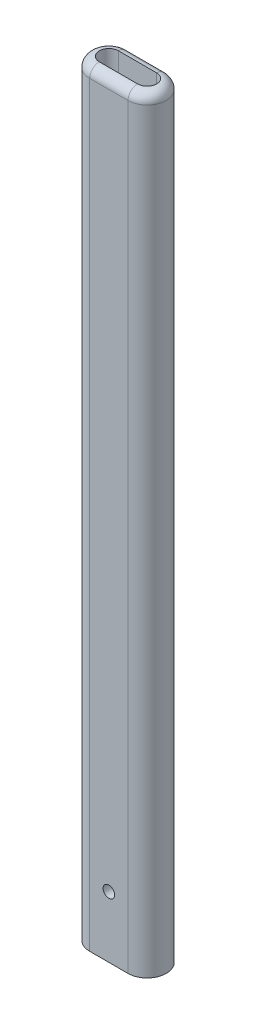
ISO-10303-21;
HEADER;
FILE_DESCRIPTION(('STEP AP214'),'2;1');
FILE_NAME('part.step','',(''),(''),'','','');
FILE_SCHEMA(('AUTOMOTIVE_DESIGN { 1 0 10303 214 1 1 1 1 }'));
ENDSEC;
DATA;
#1=APPLICATION_CONTEXT('core data for automotive mechanical design processes');
#2=APPLICATION_PROTOCOL_DEFINITION('international standard','automotive_design',2000,#1);
#3=PRODUCT_CONTEXT('',#1,'mechanical');
#4=PRODUCT('Part','Part','',(#3));
#5=PRODUCT_RELATED_PRODUCT_CATEGORY('part','',(#4));
#6=PRODUCT_DEFINITION_FORMATION('','',#4);
#7=PRODUCT_DEFINITION_CONTEXT('part definition',#1,'design');
#8=PRODUCT_DEFINITION('design','',#6,#7);
#9=PRODUCT_DEFINITION_SHAPE('','',#8);
#10=(LENGTH_UNIT() NAMED_UNIT(*) SI_UNIT(.MILLI.,.METRE.));
#11=(NAMED_UNIT(*) PLANE_ANGLE_UNIT() SI_UNIT($,.RADIAN.));
#12=(NAMED_UNIT(*) SI_UNIT($,.STERADIAN.) SOLID_ANGLE_UNIT());
#13=UNCERTAINTY_MEASURE_WITH_UNIT(LENGTH_MEASURE(1.E-05),#10,'distance_accuracy_value','');
#14=(GEOMETRIC_REPRESENTATION_CONTEXT(3) GLOBAL_UNCERTAINTY_ASSIGNED_CONTEXT((#13)) GLOBAL_UNIT_ASSIGNED_CONTEXT((#10,
#11,#12)) REPRESENTATION_CONTEXT('',''));
#15=CARTESIAN_POINT('',(0.,0.,0.));
#16=DIRECTION('',(0.,0.,1.));
#17=DIRECTION('',(1.,0.,0.));
#18=AXIS2_PLACEMENT_3D('',#15,#16,#17);
#19=CARTESIAN_POINT('',(-15.,-200.,0.));
#20=DIRECTION('',(0.,1.,0.));
#21=DIRECTION('',(0.,0.,1.));
#22=AXIS2_PLACEMENT_3D('',#19,#20,#21);
#23=PLANE('',#22);
#24=CARTESIAN_POINT('',(-15.,-200.,0.));
#25=DIRECTION('',(0.,1.,0.));
#26=DIRECTION('',(0.,0.,1.));
#27=AXIS2_PLACEMENT_3D('',#24,#25,#26);
#28=CIRCLE('',#27,10.);
#29=CARTESIAN_POINT('',(-15.,-200.,-10.));
#30=VERTEX_POINT('',#29);
#31=CARTESIAN_POINT('',(-15.,-200.,10.));
#32=VERTEX_POINT('',#31);
#33=EDGE_CURVE('E135',#30,#32,#28,.T.);
#34=ORIENTED_EDGE('',*,*,#33,.F.);
#35=DIRECTION('',(-1.,0.,0.));
#36=VECTOR('',#35,1.);
#37=CARTESIAN_POINT('',(-15.,-200.,-10.));
#38=LINE('',#37,#36);
#39=CARTESIAN_POINT('',(5.,-200.,-10.));
#40=VERTEX_POINT('',#39);
#41=EDGE_CURVE('E150',#40,#30,#38,.T.);
#42=ORIENTED_EDGE('',*,*,#41,.F.);
#43=CARTESIAN_POINT('',(5.,-200.,0.));
#44=DIRECTION('',(0.,1.,0.));
#45=DIRECTION('',(0.,0.,1.));
#46=AXIS2_PLACEMENT_3D('',#43,#44,#45);
#47=CIRCLE('',#46,10.);
#48=CARTESIAN_POINT('',(5.,-200.,10.));
#49=VERTEX_POINT('',#48);
#50=EDGE_CURVE('E147',#49,#40,#47,.T.);
#51=ORIENTED_EDGE('',*,*,#50,.F.);
#52=DIRECTION('',(1.,0.,0.));
#53=VECTOR('',#52,1.);
#54=CARTESIAN_POINT('',(-15.,-200.,10.));
#55=LINE('',#54,#53);
#56=EDGE_CURVE('E139',#32,#49,#55,.T.);
#57=ORIENTED_EDGE('',*,*,#56,.F.);
#58=EDGE_LOOP('',(#34,#42,#51,#57));
#59=FACE_BOUND('',#58,.T.);
#60=CARTESIAN_POINT('',(-15.,-200.,0.));
#61=DIRECTION('',(0.,1.,0.));
#62=DIRECTION('',(0.,0.,1.));
#63=AXIS2_PLACEMENT_3D('',#60,#61,#62);
#64=CIRCLE('',#63,5.);
#65=CARTESIAN_POINT('',(-15.,-200.,-5.));
#66=VERTEX_POINT('',#65);
#67=CARTESIAN_POINT('',(-15.,-200.,5.));
#68=VERTEX_POINT('',#67);
#69=EDGE_CURVE('E182',#66,#68,#64,.T.);
#70=ORIENTED_EDGE('',*,*,#69,.T.);
#71=DIRECTION('',(1.,0.,0.));
#72=VECTOR('',#71,1.);
#73=CARTESIAN_POINT('',(-15.,-200.,5.));
#74=LINE('',#73,#72);
#75=CARTESIAN_POINT('',(5.,-200.,5.));
#76=VERTEX_POINT('',#75);
#77=EDGE_CURVE('E134',#68,#76,#74,.T.);
#78=ORIENTED_EDGE('',*,*,#77,.T.);
#79=CARTESIAN_POINT('',(5.,-200.,0.));
#80=DIRECTION('',(0.,1.,0.));
#81=DIRECTION('',(0.,0.,1.));
#82=AXIS2_PLACEMENT_3D('',#79,#80,#81);
#83=CIRCLE('',#82,5.);
#84=CARTESIAN_POINT('',(5.,-200.,-5.));
#85=VERTEX_POINT('',#84);
#86=EDGE_CURVE('E190',#76,#85,#83,.T.);
#87=ORIENTED_EDGE('',*,*,#86,.T.);
#88=DIRECTION('',(-1.,0.,0.));
#89=VECTOR('',#88,1.);
#90=CARTESIAN_POINT('',(-15.,-200.,-5.));
#91=LINE('',#90,#89);
#92=EDGE_CURVE('E130',#85,#66,#91,.T.);
#93=ORIENTED_EDGE('',*,*,#92,.T.);
#94=EDGE_LOOP('',(#70,#78,#87,#93));
#95=FACE_BOUND('',#94,.T.);
#96=ADVANCED_FACE('F33',(#59,#95),#23,.F.);
#97=CARTESIAN_POINT('',(-15.,200.,0.));
#98=DIRECTION('',(0.,-1.,0.));
#99=DIRECTION('',(0.,0.,-1.));
#100=AXIS2_PLACEMENT_3D('',#97,#98,#99);
#101=CYLINDRICAL_SURFACE('',#100,10.);
#102=DIRECTION('',(0.,-1.,0.));
#103=VECTOR('',#102,1.);
#104=CARTESIAN_POINT('',(-15.,200.,10.));
#105=LINE('',#104,#103);
#106=CARTESIAN_POINT('',(-15.,195.,10.));
#107=VERTEX_POINT('',#106);
#108=EDGE_CURVE('E159',#107,#32,#105,.T.);
#109=ORIENTED_EDGE('',*,*,#108,.F.);
#110=CARTESIAN_POINT('',(-15.,195.,0.));
#111=DIRECTION('',(0.,1.,0.));
#112=DIRECTION('',(0.,0.,1.));
#113=AXIS2_PLACEMENT_3D('',#110,#111,#112);
#114=CIRCLE('',#113,10.);
#115=CARTESIAN_POINT('',(-15.,195.,-10.));
#116=VERTEX_POINT('',#115);
#117=EDGE_CURVE('E106',#107,#116,#114,.F.);
#118=ORIENTED_EDGE('',*,*,#117,.T.);
#119=DIRECTION('',(0.,-1.,0.));
#120=VECTOR('',#119,1.);
#121=CARTESIAN_POINT('',(-15.,200.,-10.));
#122=LINE('',#121,#120);
#123=EDGE_CURVE('E153',#116,#30,#122,.T.);
#124=ORIENTED_EDGE('',*,*,#123,.T.);
#125=ORIENTED_EDGE('',*,*,#33,.T.);
#126=EDGE_LOOP('',(#109,#118,#124,#125));
#127=FACE_BOUND('',#126,.T.);
#128=ADVANCED_FACE('F204',(#127),#101,.T.);
#129=CARTESIAN_POINT('',(-15.,200.,10.));
#130=DIRECTION('',(0.,0.,-1.));
#131=DIRECTION('',(-1.,0.,0.));
#132=AXIS2_PLACEMENT_3D('',#129,#130,#131);
#133=PLANE('',#132);
#134=CARTESIAN_POINT('',(-5.,-168.,10.));
#135=DIRECTION('',(0.,0.,1.));
#136=DIRECTION('',(1.,0.,0.));
#137=AXIS2_PLACEMENT_3D('',#134,#135,#136);
#138=CIRCLE('',#137,2.99999999999999);
#139=CARTESIAN_POINT('',(-2.,-168.,10.));
#140=VERTEX_POINT('',#139);
#141=EDGE_CURVE('E170',#140,#140,#138,.T.);
#142=ORIENTED_EDGE('',*,*,#141,.F.);
#143=EDGE_LOOP('',(#142));
#144=FACE_BOUND('',#143,.T.);
#145=DIRECTION('',(0.,-1.,0.));
#146=VECTOR('',#145,1.);
#147=CARTESIAN_POINT('',(5.,200.,10.));
#148=LINE('',#147,#146);
#149=CARTESIAN_POINT('',(5.,195.,10.));
#150=VERTEX_POINT('',#149);
#151=EDGE_CURVE('E157',#150,#49,#148,.T.);
#152=ORIENTED_EDGE('',*,*,#151,.F.);
#153=DIRECTION('',(1.,0.,0.));
#154=VECTOR('',#153,1.);
#155=CARTESIAN_POINT('',(-15.,195.,10.));
#156=LINE('',#155,#154);
#157=EDGE_CURVE('E11',#150,#107,#156,.F.);
#158=ORIENTED_EDGE('',*,*,#157,.T.);
#159=ORIENTED_EDGE('',*,*,#108,.T.);
#160=ORIENTED_EDGE('',*,*,#56,.T.);
#161=EDGE_LOOP('',(#152,#158,#159,#160));
#162=FACE_BOUND('',#161,.T.);
#163=ADVANCED_FACE('F210',(#144,#162),#133,.F.);
#164=CARTESIAN_POINT('',(5.,200.,0.));
#165=DIRECTION('',(0.,-1.,0.));
#166=DIRECTION('',(0.,0.,-1.));
#167=AXIS2_PLACEMENT_3D('',#164,#165,#166);
#168=CYLINDRICAL_SURFACE('',#167,10.);
#169=DIRECTION('',(0.,-1.,0.));
#170=VECTOR('',#169,1.);
#171=CARTESIAN_POINT('',(5.,200.,-10.));
#172=LINE('',#171,#170);
#173=CARTESIAN_POINT('',(5.,195.,-10.));
#174=VERTEX_POINT('',#173);
#175=EDGE_CURVE('E155',#174,#40,#172,.T.);
#176=ORIENTED_EDGE('',*,*,#175,.F.);
#177=CARTESIAN_POINT('',(5.,195.,0.));
#178=DIRECTION('',(0.,1.,0.));
#179=DIRECTION('',(0.,0.,1.));
#180=AXIS2_PLACEMENT_3D('',#177,#178,#179);
#181=CIRCLE('',#180,10.);
#182=EDGE_CURVE('E42',#174,#150,#181,.F.);
#183=ORIENTED_EDGE('',*,*,#182,.T.);
#184=ORIENTED_EDGE('',*,*,#151,.T.);
#185=ORIENTED_EDGE('',*,*,#50,.T.);
#186=EDGE_LOOP('',(#176,#183,#184,#185));
#187=FACE_BOUND('',#186,.T.);
#188=ADVANCED_FACE('F220',(#187),#168,.T.);
#189=CARTESIAN_POINT('',(-15.,200.,-10.));
#190=DIRECTION('',(0.,0.,1.));
#191=DIRECTION('',(1.,0.,0.));
#192=AXIS2_PLACEMENT_3D('',#189,#190,#191);
#193=PLANE('',#192);
#194=CARTESIAN_POINT('',(-5.,-168.,-10.));
#195=DIRECTION('',(0.,0.,1.));
#196=DIRECTION('',(1.,0.,0.));
#197=AXIS2_PLACEMENT_3D('',#194,#195,#196);
#198=CIRCLE('',#197,2.99999999999999);
#199=CARTESIAN_POINT('',(-2.,-168.,-10.));
#200=VERTEX_POINT('',#199);
#201=EDGE_CURVE('E165',#200,#200,#198,.T.);
#202=ORIENTED_EDGE('',*,*,#201,.T.);
#203=EDGE_LOOP('',(#202));
#204=FACE_BOUND('',#203,.T.);
#205=ORIENTED_EDGE('',*,*,#123,.F.);
#206=DIRECTION('',(-1.,0.,0.));
#207=VECTOR('',#206,1.);
#208=CARTESIAN_POINT('',(5.,195.,-10.));
#209=LINE('',#208,#207);
#210=EDGE_CURVE('E57',#116,#174,#209,.F.);
#211=ORIENTED_EDGE('',*,*,#210,.T.);
#212=ORIENTED_EDGE('',*,*,#175,.T.);
#213=ORIENTED_EDGE('',*,*,#41,.T.);
#214=EDGE_LOOP('',(#205,#211,#212,#213));
#215=FACE_BOUND('',#214,.T.);
#216=ADVANCED_FACE('F217',(#204,#215),#193,.F.);
#217=CARTESIAN_POINT('',(-15.,200.,0.));
#218=DIRECTION('',(0.,-1.,0.));
#219=DIRECTION('',(0.,0.,-1.));
#220=AXIS2_PLACEMENT_3D('',#217,#218,#219);
#221=CYLINDRICAL_SURFACE('',#220,5.);
#222=ORIENTED_EDGE('',*,*,#69,.F.);
#223=DIRECTION('',(0.,-1.,0.));
#224=VECTOR('',#223,1.);
#225=CARTESIAN_POINT('',(-15.,200.,-5.));
#226=LINE('',#225,#224);
#227=CARTESIAN_POINT('',(-15.,200.,-5.));
#228=VERTEX_POINT('',#227);
#229=EDGE_CURVE('E128',#228,#66,#226,.T.);
#230=ORIENTED_EDGE('',*,*,#229,.F.);
#231=CARTESIAN_POINT('',(-15.,200.,0.));
#232=DIRECTION('',(0.,1.,0.));
#233=DIRECTION('',(0.,0.,1.));
#234=AXIS2_PLACEMENT_3D('',#231,#232,#233);
#235=CIRCLE('',#234,5.);
#236=CARTESIAN_POINT('',(-15.,200.,5.));
#237=VERTEX_POINT('',#236);
#238=EDGE_CURVE('E104',#228,#237,#235,.T.);
#239=ORIENTED_EDGE('',*,*,#238,.T.);
#240=DIRECTION('',(0.,-1.,0.));
#241=VECTOR('',#240,1.);
#242=CARTESIAN_POINT('',(-15.,200.,5.));
#243=LINE('',#242,#241);
#244=EDGE_CURVE('E125',#237,#68,#243,.T.);
#245=ORIENTED_EDGE('',*,*,#244,.T.);
#246=EDGE_LOOP('',(#222,#230,#239,#245));
#247=FACE_BOUND('',#246,.T.);
#248=ADVANCED_FACE('F124',(#247),#221,.F.);
#249=CARTESIAN_POINT('',(-15.,200.,5.));
#250=DIRECTION('',(0.,0.,-1.));
#251=DIRECTION('',(-1.,0.,0.));
#252=AXIS2_PLACEMENT_3D('',#249,#250,#251);
#253=PLANE('',#252);
#254=CARTESIAN_POINT('',(-5.,-168.,5.));
#255=DIRECTION('',(0.,0.,-1.));
#256=DIRECTION('',(-1.,0.,0.));
#257=AXIS2_PLACEMENT_3D('',#254,#255,#256);
#258=CIRCLE('',#257,2.99999999999999);
#259=CARTESIAN_POINT('',(-7.99999999999999,-168.,5.));
#260=VERTEX_POINT('',#259);
#261=EDGE_CURVE('E164',#260,#260,#258,.T.);
#262=ORIENTED_EDGE('',*,*,#261,.F.);
#263=EDGE_LOOP('',(#262));
#264=FACE_BOUND('',#263,.T.);
#265=ORIENTED_EDGE('',*,*,#77,.F.);
#266=ORIENTED_EDGE('',*,*,#244,.F.);
#267=DIRECTION('',(1.,0.,0.));
#268=VECTOR('',#267,1.);
#269=CARTESIAN_POINT('',(-15.,200.,5.));
#270=LINE('',#269,#268);
#271=CARTESIAN_POINT('',(5.,200.,5.));
#272=VERTEX_POINT('',#271);
#273=EDGE_CURVE('E112',#237,#272,#270,.T.);
#274=ORIENTED_EDGE('',*,*,#273,.T.);
#275=DIRECTION('',(0.,-1.,0.));
#276=VECTOR('',#275,1.);
#277=CARTESIAN_POINT('',(5.,200.,5.));
#278=LINE('',#277,#276);
#279=EDGE_CURVE('E136',#272,#76,#278,.T.);
#280=ORIENTED_EDGE('',*,*,#279,.T.);
#281=EDGE_LOOP('',(#265,#266,#274,#280));
#282=FACE_BOUND('',#281,.T.);
#283=ADVANCED_FACE('F132',(#264,#282),#253,.T.);
#284=CARTESIAN_POINT('',(5.,200.,0.));
#285=DIRECTION('',(0.,-1.,0.));
#286=DIRECTION('',(0.,0.,-1.));
#287=AXIS2_PLACEMENT_3D('',#284,#285,#286);
#288=CYLINDRICAL_SURFACE('',#287,5.);
#289=ORIENTED_EDGE('',*,*,#86,.F.);
#290=ORIENTED_EDGE('',*,*,#279,.F.);
#291=CARTESIAN_POINT('',(5.,200.,0.));
#292=DIRECTION('',(0.,1.,0.));
#293=DIRECTION('',(0.,0.,1.));
#294=AXIS2_PLACEMENT_3D('',#291,#292,#293);
#295=CIRCLE('',#294,5.);
#296=CARTESIAN_POINT('',(5.,200.,-5.));
#297=VERTEX_POINT('',#296);
#298=EDGE_CURVE('E119',#272,#297,#295,.T.);
#299=ORIENTED_EDGE('',*,*,#298,.T.);
#300=DIRECTION('',(0.,-1.,0.));
#301=VECTOR('',#300,1.);
#302=CARTESIAN_POINT('',(5.,200.,-5.));
#303=LINE('',#302,#301);
#304=EDGE_CURVE('E141',#297,#85,#303,.T.);
#305=ORIENTED_EDGE('',*,*,#304,.T.);
#306=EDGE_LOOP('',(#289,#290,#299,#305));
#307=FACE_BOUND('',#306,.T.);
#308=ADVANCED_FACE('F198',(#307),#288,.F.);
#309=CARTESIAN_POINT('',(-15.,200.,-5.));
#310=DIRECTION('',(0.,0.,1.));
#311=DIRECTION('',(1.,0.,0.));
#312=AXIS2_PLACEMENT_3D('',#309,#310,#311);
#313=PLANE('',#312);
#314=CARTESIAN_POINT('',(-5.,-168.,-5.));
#315=DIRECTION('',(0.,0.,1.));
#316=DIRECTION('',(1.,0.,0.));
#317=AXIS2_PLACEMENT_3D('',#314,#315,#316);
#318=CIRCLE('',#317,2.99999999999999);
#319=CARTESIAN_POINT('',(-2.,-168.,-5.));
#320=VERTEX_POINT('',#319);
#321=EDGE_CURVE('E161',#320,#320,#318,.T.);
#322=ORIENTED_EDGE('',*,*,#321,.F.);
#323=EDGE_LOOP('',(#322));
#324=FACE_BOUND('',#323,.T.);
#325=ORIENTED_EDGE('',*,*,#92,.F.);
#326=ORIENTED_EDGE('',*,*,#304,.F.);
#327=DIRECTION('',(-1.,0.,0.));
#328=VECTOR('',#327,1.);
#329=CARTESIAN_POINT('',(-15.,200.,-5.));
#330=LINE('',#329,#328);
#331=EDGE_CURVE('E186',#297,#228,#330,.T.);
#332=ORIENTED_EDGE('',*,*,#331,.T.);
#333=ORIENTED_EDGE('',*,*,#229,.T.);
#334=EDGE_LOOP('',(#325,#326,#332,#333));
#335=FACE_BOUND('',#334,.T.);
#336=ADVANCED_FACE('F201',(#324,#335),#313,.T.);
#337=CARTESIAN_POINT('',(-5.,-168.,-10.));
#338=DIRECTION('',(0.,0.,1.));
#339=DIRECTION('',(1.,0.,0.));
#340=AXIS2_PLACEMENT_3D('',#337,#338,#339);
#341=CYLINDRICAL_SURFACE('',#340,2.99999999999999);
#342=ORIENTED_EDGE('',*,*,#321,.T.);
#343=EDGE_LOOP('',(#342));
#344=FACE_BOUND('',#343,.T.);
#345=ORIENTED_EDGE('',*,*,#201,.F.);
#346=EDGE_LOOP('',(#345));
#347=FACE_BOUND('',#346,.T.);
#348=ADVANCED_FACE('F240',(#344,#347),#341,.F.);
#349=ORIENTED_EDGE('',*,*,#261,.T.);
#350=EDGE_LOOP('',(#349));
#351=FACE_BOUND('',#350,.T.);
#352=ORIENTED_EDGE('',*,*,#141,.T.);
#353=EDGE_LOOP('',(#352));
#354=FACE_BOUND('',#353,.T.);
#355=ADVANCED_FACE('F235',(#351,#354),#341,.F.);
#356=CARTESIAN_POINT('',(5.,195.,0.));
#357=DIRECTION('',(0.,1.,0.));
#358=DIRECTION('',(0.,0.,1.));
#359=AXIS2_PLACEMENT_3D('',#356,#357,#358);
#360=DEGENERATE_TOROIDAL_SURFACE('',#359,5.,5.,.T.);
#361=CARTESIAN_POINT('',(5.,195.,5.));
#362=DIRECTION('',(-1.,0.,0.));
#363=DIRECTION('',(0.,0.,1.));
#364=AXIS2_PLACEMENT_3D('',#361,#362,#363);
#365=CIRCLE('',#364,5.);
#366=EDGE_CURVE('E115',#150,#272,#365,.T.);
#367=ORIENTED_EDGE('',*,*,#366,.F.);
#368=ORIENTED_EDGE('',*,*,#182,.F.);
#369=CARTESIAN_POINT('',(5.,195.,-5.));
#370=DIRECTION('',(-1.,0.,0.));
#371=DIRECTION('',(0.,0.,1.));
#372=AXIS2_PLACEMENT_3D('',#369,#370,#371);
#373=CIRCLE('',#372,5.);
#374=EDGE_CURVE('E37',#297,#174,#373,.T.);
#375=ORIENTED_EDGE('',*,*,#374,.F.);
#376=ORIENTED_EDGE('',*,*,#298,.F.);
#377=EDGE_LOOP('',(#367,#368,#375,#376));
#378=FACE_BOUND('',#377,.T.);
#379=ADVANCED_FACE('F35',(#378),#360,.T.);
#380=CARTESIAN_POINT('',(-15.,195.,-5.));
#381=DIRECTION('',(1.,0.,0.));
#382=DIRECTION('',(0.,0.,-1.));
#383=AXIS2_PLACEMENT_3D('',#380,#381,#382);
#384=CYLINDRICAL_SURFACE('',#383,5.);
#385=ORIENTED_EDGE('',*,*,#374,.T.);
#386=ORIENTED_EDGE('',*,*,#210,.F.);
#387=CARTESIAN_POINT('',(-15.,195.,-5.));
#388=DIRECTION('',(-1.,0.,0.));
#389=DIRECTION('',(0.,0.,1.));
#390=AXIS2_PLACEMENT_3D('',#387,#388,#389);
#391=CIRCLE('',#390,5.);
#392=EDGE_CURVE('E109',#228,#116,#391,.T.);
#393=ORIENTED_EDGE('',*,*,#392,.F.);
#394=ORIENTED_EDGE('',*,*,#331,.F.);
#395=EDGE_LOOP('',(#385,#386,#393,#394));
#396=FACE_BOUND('',#395,.T.);
#397=ADVANCED_FACE('F230',(#396),#384,.T.);
#398=CARTESIAN_POINT('',(-15.,195.,5.));
#399=DIRECTION('',(-1.,0.,0.));
#400=DIRECTION('',(0.,0.,1.));
#401=AXIS2_PLACEMENT_3D('',#398,#399,#400);
#402=CYLINDRICAL_SURFACE('',#401,5.);
#403=ORIENTED_EDGE('',*,*,#366,.T.);
#404=ORIENTED_EDGE('',*,*,#273,.F.);
#405=CARTESIAN_POINT('',(-15.,195.,5.));
#406=DIRECTION('',(-1.,0.,0.));
#407=DIRECTION('',(0.,0.,1.));
#408=AXIS2_PLACEMENT_3D('',#405,#406,#407);
#409=CIRCLE('',#408,5.);
#410=EDGE_CURVE('E100',#107,#237,#409,.T.);
#411=ORIENTED_EDGE('',*,*,#410,.F.);
#412=ORIENTED_EDGE('',*,*,#157,.F.);
#413=EDGE_LOOP('',(#403,#404,#411,#412));
#414=FACE_BOUND('',#413,.T.);
#415=ADVANCED_FACE('F113',(#414),#402,.T.);
#416=CARTESIAN_POINT('',(-15.,195.,0.));
#417=DIRECTION('',(0.,1.,0.));
#418=DIRECTION('',(0.,0.,1.));
#419=AXIS2_PLACEMENT_3D('',#416,#417,#418);
#420=DEGENERATE_TOROIDAL_SURFACE('',#419,5.,5.,.T.);
#421=ORIENTED_EDGE('',*,*,#392,.T.);
#422=ORIENTED_EDGE('',*,*,#117,.F.);
#423=ORIENTED_EDGE('',*,*,#410,.T.);
#424=ORIENTED_EDGE('',*,*,#238,.F.);
#425=EDGE_LOOP('',(#421,#422,#423,#424));
#426=FACE_BOUND('',#425,.T.);
#427=ADVANCED_FACE('F102',(#426),#420,.T.);
#428=CLOSED_SHELL('',(#96,#128,#163,#188,#216,#248,#283,#308,#336,#348,#355,#379,#397,#415,#427));
#429=MANIFOLD_SOLID_BREP('B2',#428);
#430=ADVANCED_BREP_SHAPE_REPRESENTATION('',(#18,#429),#14);
#431=SHAPE_DEFINITION_REPRESENTATION(#9,#430);
ENDSEC;
END-ISO-10303-21;
